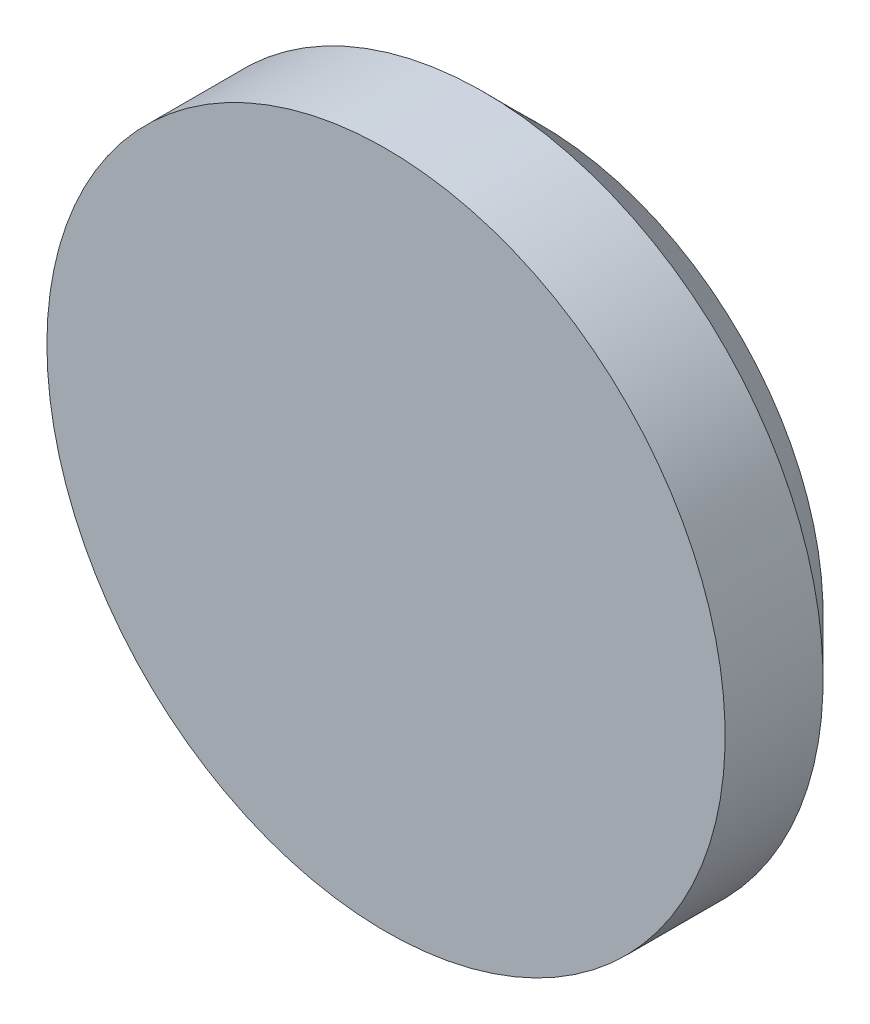
ISO-10303-21;
HEADER;
FILE_DESCRIPTION(('STEP AP214'),'2;1');
FILE_NAME('part.step','',(''),(''),'','','');
FILE_SCHEMA(('AUTOMOTIVE_DESIGN { 1 0 10303 214 1 1 1 1 }'));
ENDSEC;
DATA;
#1=APPLICATION_CONTEXT('core data for automotive mechanical design processes');
#2=APPLICATION_PROTOCOL_DEFINITION('international standard','automotive_design',2000,#1);
#3=PRODUCT_CONTEXT('',#1,'mechanical');
#4=PRODUCT('Part','Part','',(#3));
#5=PRODUCT_RELATED_PRODUCT_CATEGORY('part','',(#4));
#6=PRODUCT_DEFINITION_FORMATION('','',#4);
#7=PRODUCT_DEFINITION_CONTEXT('part definition',#1,'design');
#8=PRODUCT_DEFINITION('design','',#6,#7);
#9=PRODUCT_DEFINITION_SHAPE('','',#8);
#10=(LENGTH_UNIT() NAMED_UNIT(*) SI_UNIT(.MILLI.,.METRE.));
#11=(NAMED_UNIT(*) PLANE_ANGLE_UNIT() SI_UNIT($,.RADIAN.));
#12=(NAMED_UNIT(*) SI_UNIT($,.STERADIAN.) SOLID_ANGLE_UNIT());
#13=UNCERTAINTY_MEASURE_WITH_UNIT(LENGTH_MEASURE(1.E-05),#10,'distance_accuracy_value','');
#14=(GEOMETRIC_REPRESENTATION_CONTEXT(3) GLOBAL_UNCERTAINTY_ASSIGNED_CONTEXT((#13)) GLOBAL_UNIT_ASSIGNED_CONTEXT((#10,
#11,#12)) REPRESENTATION_CONTEXT('',''));
#15=CARTESIAN_POINT('',(0.,0.,0.));
#16=DIRECTION('',(0.,0.,1.));
#17=DIRECTION('',(1.,0.,0.));
#18=AXIS2_PLACEMENT_3D('',#15,#16,#17);
#19=CARTESIAN_POINT('',(0.,0.,0.));
#20=DIRECTION('',(0.,0.,1.));
#21=DIRECTION('',(1.,0.,0.));
#22=AXIS2_PLACEMENT_3D('',#19,#20,#21);
#23=PLANE('',#22);
#24=CARTESIAN_POINT('',(0.,0.,0.));
#25=DIRECTION('',(0.,0.,-1.));
#26=DIRECTION('',(-1.,0.,0.));
#27=AXIS2_PLACEMENT_3D('',#24,#25,#26);
#28=CIRCLE('',#27,9.);
#29=CARTESIAN_POINT('',(-9.,0.,0.));
#30=VERTEX_POINT('',#29);
#31=EDGE_CURVE('E10',#30,#30,#28,.T.);
#32=ORIENTED_EDGE('',*,*,#31,.F.);
#33=EDGE_LOOP('',(#32));
#34=FACE_BOUND('',#33,.T.);
#35=ADVANCED_FACE('F32',(#34),#23,.T.);
#36=CARTESIAN_POINT('',(0.,0.,0.));
#37=DIRECTION('',(0.,0.,-1.));
#38=DIRECTION('',(-1.,0.,0.));
#39=AXIS2_PLACEMENT_3D('',#36,#37,#38);
#40=CYLINDRICAL_SURFACE('',#39,9.);
#41=ORIENTED_EDGE('',*,*,#31,.T.);
#42=EDGE_LOOP('',(#41));
#43=FACE_BOUND('',#42,.T.);
#44=CARTESIAN_POINT('',(0.,0.,-2.59999999999999));
#45=DIRECTION('',(0.,0.,-1.));
#46=DIRECTION('',(-1.,0.,0.));
#47=AXIS2_PLACEMENT_3D('',#44,#45,#46);
#48=CIRCLE('',#47,9.);
#49=CARTESIAN_POINT('',(-9.,0.,-2.59999999999999));
#50=VERTEX_POINT('',#49);
#51=EDGE_CURVE('E38',#50,#50,#48,.T.);
#52=ORIENTED_EDGE('',*,*,#51,.F.);
#53=EDGE_LOOP('',(#52));
#54=FACE_BOUND('',#53,.T.);
#55=ADVANCED_FACE('F53',(#43,#54),#40,.T.);
#56=CARTESIAN_POINT('',(0.,0.,-4.1));
#57=DIRECTION('',(0.,0.,1.));
#58=DIRECTION('',(1.,0.,0.));
#59=AXIS2_PLACEMENT_3D('',#56,#57,#58);
#60=CONICAL_SURFACE('',#59,7.5,0.785398163397446);
#61=ORIENTED_EDGE('',*,*,#51,.T.);
#62=EDGE_LOOP('',(#61));
#63=FACE_BOUND('',#62,.T.);
#64=CARTESIAN_POINT('',(0.,0.,-4.1));
#65=DIRECTION('',(0.,0.,-1.));
#66=DIRECTION('',(-1.,0.,0.));
#67=AXIS2_PLACEMENT_3D('',#64,#65,#66);
#68=CIRCLE('',#67,7.5);
#69=CARTESIAN_POINT('',(-7.5,0.,-4.1));
#70=VERTEX_POINT('',#69);
#71=EDGE_CURVE('E42',#70,#70,#68,.T.);
#72=ORIENTED_EDGE('',*,*,#71,.F.);
#73=EDGE_LOOP('',(#72));
#74=FACE_BOUND('',#73,.T.);
#75=ADVANCED_FACE('F51',(#63,#74),#60,.T.);
#76=CARTESIAN_POINT('',(-7.5,0.,-4.1));
#77=DIRECTION('',(0.,0.,-1.));
#78=DIRECTION('',(-1.,0.,0.));
#79=AXIS2_PLACEMENT_3D('',#76,#77,#78);
#80=PLANE('',#79);
#81=ORIENTED_EDGE('',*,*,#71,.T.);
#82=EDGE_LOOP('',(#81));
#83=FACE_BOUND('',#82,.T.);
#84=ADVANCED_FACE('F49',(#83),#80,.T.);
#85=CLOSED_SHELL('',(#35,#55,#75,#84));
#86=MANIFOLD_SOLID_BREP('B2',#85);
#87=ADVANCED_BREP_SHAPE_REPRESENTATION('',(#18,#86),#14);
#88=SHAPE_DEFINITION_REPRESENTATION(#9,#87);
ENDSEC;
END-ISO-10303-21;
